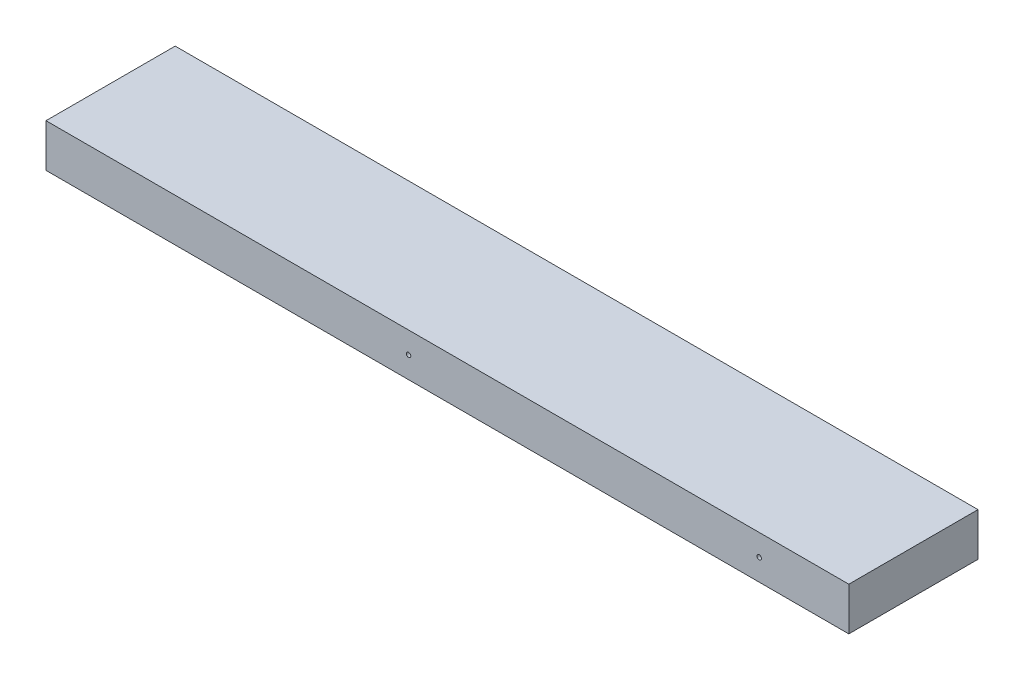
ISO-10303-21;
HEADER;
FILE_DESCRIPTION(('STEP AP214'),'2;1');
FILE_NAME('part.step','',(''),(''),'','','');
FILE_SCHEMA(('AUTOMOTIVE_DESIGN { 1 0 10303 214 1 1 1 1 }'));
ENDSEC;
DATA;
#1=APPLICATION_CONTEXT('core data for automotive mechanical design processes');
#2=APPLICATION_PROTOCOL_DEFINITION('international standard','automotive_design',2000,#1);
#3=PRODUCT_CONTEXT('',#1,'mechanical');
#4=PRODUCT('Part','Part','',(#3));
#5=PRODUCT_RELATED_PRODUCT_CATEGORY('part','',(#4));
#6=PRODUCT_DEFINITION_FORMATION('','',#4);
#7=PRODUCT_DEFINITION_CONTEXT('part definition',#1,'design');
#8=PRODUCT_DEFINITION('design','',#6,#7);
#9=PRODUCT_DEFINITION_SHAPE('','',#8);
#10=(LENGTH_UNIT() NAMED_UNIT(*) SI_UNIT(.MILLI.,.METRE.));
#11=(NAMED_UNIT(*) PLANE_ANGLE_UNIT() SI_UNIT($,.RADIAN.));
#12=(NAMED_UNIT(*) SI_UNIT($,.STERADIAN.) SOLID_ANGLE_UNIT());
#13=UNCERTAINTY_MEASURE_WITH_UNIT(LENGTH_MEASURE(1.E-05),#10,'distance_accuracy_value','');
#14=(GEOMETRIC_REPRESENTATION_CONTEXT(3) GLOBAL_UNCERTAINTY_ASSIGNED_CONTEXT((#13)) GLOBAL_UNIT_ASSIGNED_CONTEXT((#10,
#11,#12)) REPRESENTATION_CONTEXT('',''));
#15=CARTESIAN_POINT('',(0.,0.,0.));
#16=DIRECTION('',(0.,0.,1.));
#17=DIRECTION('',(1.,0.,0.));
#18=AXIS2_PLACEMENT_3D('',#15,#16,#17);
#19=CARTESIAN_POINT('',(-86.3599999999984,5213.35,2683.51));
#20=DIRECTION('',(0.,-1.,0.));
#21=DIRECTION('',(0.,0.,-1.));
#22=AXIS2_PLACEMENT_3D('',#19,#20,#21);
#23=PLANE('',#22);
#24=DIRECTION('',(0.,0.,-1.));
#25=VECTOR('',#24,1.);
#26=CARTESIAN_POINT('',(-90.1229654482436,5213.35,2740.66));
#27=LINE('',#26,#25);
#28=CARTESIAN_POINT('',(-90.1229654482436,5213.35,2740.66));
#29=VERTEX_POINT('',#28);
#30=CARTESIAN_POINT('',(-90.1229654482432,5213.35,2683.51));
#31=VERTEX_POINT('',#30);
#32=EDGE_CURVE('E101',#29,#31,#27,.T.);
#33=ORIENTED_EDGE('',*,*,#32,.F.);
#34=DIRECTION('',(1.,0.,0.));
#35=VECTOR('',#34,1.);
#36=CARTESIAN_POINT('',(-265.815570864871,5213.35,2740.66));
#37=LINE('',#36,#35);
#38=CARTESIAN_POINT('',(-445.271141729743,5213.35,2740.66));
#39=VERTEX_POINT('',#38);
#40=EDGE_CURVE('E109',#39,#29,#37,.T.);
#41=ORIENTED_EDGE('',*,*,#40,.F.);
#42=DIRECTION('',(0.,0.,-1.));
#43=VECTOR('',#42,1.);
#44=CARTESIAN_POINT('',(-445.271141729742,5213.35,2683.51));
#45=LINE('',#44,#43);
#46=CARTESIAN_POINT('',(-445.271141729742,5213.35,2683.51));
#47=VERTEX_POINT('',#46);
#48=EDGE_CURVE('E115',#39,#47,#45,.T.);
#49=ORIENTED_EDGE('',*,*,#48,.T.);
#50=DIRECTION('',(-1.,0.,0.));
#51=VECTOR('',#50,1.);
#52=CARTESIAN_POINT('',(-265.81557086487,5213.35,2683.51));
#53=LINE('',#52,#51);
#54=EDGE_CURVE('E110',#31,#47,#53,.T.);
#55=ORIENTED_EDGE('',*,*,#54,.F.);
#56=EDGE_LOOP('',(#33,#41,#49,#55));
#57=FACE_BOUND('',#56,.T.);
#58=ADVANCED_FACE('F46',(#57),#23,.T.);
#59=CARTESIAN_POINT('',(-265.815570864871,5222.875,2740.66));
#60=DIRECTION('',(0.,0.,-1.));
#61=DIRECTION('',(1.,0.,0.));
#62=AXIS2_PLACEMENT_3D('',#59,#60,#61);
#63=PLANE('',#62);
#64=CARTESIAN_POINT('',(-129.74574903147,5222.875,2740.66));
#65=DIRECTION('',(0.,0.,1.));
#66=DIRECTION('',(1.,0.,0.));
#67=AXIS2_PLACEMENT_3D('',#64,#65,#66);
#68=CIRCLE('',#67,0.991870000000006);
#69=CARTESIAN_POINT('',(-128.75387903147,5222.875,2740.66));
#70=VERTEX_POINT('',#69);
#71=EDGE_CURVE('E49',#70,#70,#68,.T.);
#72=ORIENTED_EDGE('',*,*,#71,.F.);
#73=EDGE_LOOP('',(#72));
#74=FACE_BOUND('',#73,.T.);
#75=CARTESIAN_POINT('',(-284.876857239857,5222.875,2740.66));
#76=DIRECTION('',(0.,0.,1.));
#77=DIRECTION('',(1.,0.,0.));
#78=AXIS2_PLACEMENT_3D('',#75,#76,#77);
#79=CIRCLE('',#78,0.991870000000006);
#80=CARTESIAN_POINT('',(-283.884987239857,5222.875,2740.66));
#81=VERTEX_POINT('',#80);
#82=EDGE_CURVE('E113',#81,#81,#79,.T.);
#83=ORIENTED_EDGE('',*,*,#82,.F.);
#84=EDGE_LOOP('',(#83));
#85=FACE_BOUND('',#84,.T.);
#86=ORIENTED_EDGE('',*,*,#40,.T.);
#87=DIRECTION('',(0.,1.,0.));
#88=VECTOR('',#87,1.);
#89=CARTESIAN_POINT('',(-90.1229654482436,5213.35,2740.66));
#90=LINE('',#89,#88);
#91=CARTESIAN_POINT('',(-90.1229654482438,5232.4,2740.66));
#92=VERTEX_POINT('',#91);
#93=EDGE_CURVE('E98',#29,#92,#90,.T.);
#94=ORIENTED_EDGE('',*,*,#93,.T.);
#95=DIRECTION('',(-1.,0.,0.));
#96=VECTOR('',#95,1.);
#97=CARTESIAN_POINT('',(-445.271141729744,5232.4,2740.66));
#98=LINE('',#97,#96);
#99=CARTESIAN_POINT('',(-445.271141729743,5232.4,2740.66));
#100=VERTEX_POINT('',#99);
#101=EDGE_CURVE('E125',#92,#100,#98,.T.);
#102=ORIENTED_EDGE('',*,*,#101,.T.);
#103=DIRECTION('',(0.,1.,0.));
#104=VECTOR('',#103,1.);
#105=CARTESIAN_POINT('',(-445.271141729743,5213.35,2740.66));
#106=LINE('',#105,#104);
#107=EDGE_CURVE('E83',#100,#39,#106,.F.);
#108=ORIENTED_EDGE('',*,*,#107,.T.);
#109=EDGE_LOOP('',(#86,#94,#102,#108));
#110=FACE_BOUND('',#109,.T.);
#111=ADVANCED_FACE('F112',(#74,#85,#110),#63,.F.);
#112=CARTESIAN_POINT('',(-445.271141729742,5213.35,2683.51));
#113=DIRECTION('',(-1.,0.,0.));
#114=DIRECTION('',(0.,0.,-1.));
#115=AXIS2_PLACEMENT_3D('',#112,#113,#114);
#116=PLANE('',#115);
#117=DIRECTION('',(0.,1.,0.));
#118=VECTOR('',#117,1.);
#119=CARTESIAN_POINT('',(-445.271141729742,5222.875,2683.51));
#120=LINE('',#119,#118);
#121=CARTESIAN_POINT('',(-445.271141729744,5232.4,2683.51));
#122=VERTEX_POINT('',#121);
#123=EDGE_CURVE('E122',#47,#122,#120,.T.);
#124=ORIENTED_EDGE('',*,*,#123,.F.);
#125=ORIENTED_EDGE('',*,*,#48,.F.);
#126=ORIENTED_EDGE('',*,*,#107,.F.);
#127=DIRECTION('',(0.,0.,1.));
#128=VECTOR('',#127,1.);
#129=CARTESIAN_POINT('',(-445.271141729744,5232.4,2683.51));
#130=LINE('',#129,#128);
#131=EDGE_CURVE('E54',#100,#122,#130,.F.);
#132=ORIENTED_EDGE('',*,*,#131,.T.);
#133=EDGE_LOOP('',(#124,#125,#126,#132));
#134=FACE_BOUND('',#133,.T.);
#135=ADVANCED_FACE('F139',(#134),#116,.T.);
#136=CARTESIAN_POINT('',(-265.815570864871,5222.875,2683.51));
#137=DIRECTION('',(0.,0.,1.));
#138=DIRECTION('',(-1.,0.,0.));
#139=AXIS2_PLACEMENT_3D('',#136,#137,#138);
#140=PLANE('',#139);
#141=DIRECTION('',(-1.,0.,0.));
#142=VECTOR('',#141,1.);
#143=CARTESIAN_POINT('',(-445.271141729744,5232.4,2683.51));
#144=LINE('',#143,#142);
#145=CARTESIAN_POINT('',(-90.1229654482437,5232.4,2683.51));
#146=VERTEX_POINT('',#145);
#147=EDGE_CURVE('E11',#122,#146,#144,.F.);
#148=ORIENTED_EDGE('',*,*,#147,.T.);
#149=DIRECTION('',(0.,1.,0.));
#150=VECTOR('',#149,1.);
#151=CARTESIAN_POINT('',(-90.1229654482432,5213.35,2683.51));
#152=LINE('',#151,#150);
#153=EDGE_CURVE('E62',#31,#146,#152,.T.);
#154=ORIENTED_EDGE('',*,*,#153,.F.);
#155=ORIENTED_EDGE('',*,*,#54,.T.);
#156=ORIENTED_EDGE('',*,*,#123,.T.);
#157=EDGE_LOOP('',(#148,#154,#155,#156));
#158=FACE_BOUND('',#157,.T.);
#159=ADVANCED_FACE('F136',(#158),#140,.F.);
#160=CARTESIAN_POINT('',(-445.271141729744,5232.4,2683.51));
#161=DIRECTION('',(0.,1.,0.));
#162=DIRECTION('',(0.,0.,1.));
#163=AXIS2_PLACEMENT_3D('',#160,#161,#162);
#164=PLANE('',#163);
#165=DIRECTION('',(0.,0.,-1.));
#166=VECTOR('',#165,1.);
#167=CARTESIAN_POINT('',(-90.1229654482438,5232.4,2740.66));
#168=LINE('',#167,#166);
#169=EDGE_CURVE('E102',#92,#146,#168,.T.);
#170=ORIENTED_EDGE('',*,*,#169,.T.);
#171=ORIENTED_EDGE('',*,*,#147,.F.);
#172=ORIENTED_EDGE('',*,*,#131,.F.);
#173=ORIENTED_EDGE('',*,*,#101,.F.);
#174=EDGE_LOOP('',(#170,#171,#172,#173));
#175=FACE_BOUND('',#174,.T.);
#176=ADVANCED_FACE('F134',(#175),#164,.T.);
#177=CARTESIAN_POINT('',(-284.876857239857,5222.875,2759.71000000001));
#178=DIRECTION('',(0.,0.,1.));
#179=DIRECTION('',(-1.,0.,0.));
#180=AXIS2_PLACEMENT_3D('',#177,#178,#179);
#181=CYLINDRICAL_SURFACE('',#180,0.991870000000006);
#182=CARTESIAN_POINT('',(-284.876857239858,5222.875,2721.61000000001));
#183=DIRECTION('',(0.,0.,-1.));
#184=DIRECTION('',(-1.,0.,0.));
#185=AXIS2_PLACEMENT_3D('',#182,#183,#184);
#186=CIRCLE('',#185,0.991870000000006);
#187=CARTESIAN_POINT('',(-285.868727239858,5222.875,2721.61000000001));
#188=VERTEX_POINT('',#187);
#189=EDGE_CURVE('E118',#188,#188,#186,.T.);
#190=ORIENTED_EDGE('',*,*,#189,.T.);
#191=EDGE_LOOP('',(#190));
#192=FACE_BOUND('',#191,.T.);
#193=ORIENTED_EDGE('',*,*,#82,.T.);
#194=EDGE_LOOP('',(#193));
#195=FACE_BOUND('',#194,.T.);
#196=ADVANCED_FACE('F179',(#192,#195),#181,.F.);
#197=CARTESIAN_POINT('',(-284.876857239858,5222.875,2721.61000000001));
#198=DIRECTION('',(0.,0.,1.));
#199=DIRECTION('',(-1.,0.,0.));
#200=AXIS2_PLACEMENT_3D('',#197,#198,#199);
#201=CONICAL_SURFACE('',#200,0.991870000000006,1.02974425867677);
#202=CARTESIAN_POINT('',(-284.876857239857,5222.875,2721.01402437781));
#203=VERTEX_POINT('',#202);
#204=VERTEX_LOOP('',#203);
#205=FACE_BOUND('',#204,.T.);
#206=ORIENTED_EDGE('',*,*,#189,.F.);
#207=EDGE_LOOP('',(#206));
#208=FACE_BOUND('',#207,.T.);
#209=ADVANCED_FACE('F192',(#205,#208),#201,.F.);
#210=CARTESIAN_POINT('',(-129.745749031471,5222.875,2759.71000000001));
#211=DIRECTION('',(0.,0.,1.));
#212=DIRECTION('',(-1.,0.,0.));
#213=AXIS2_PLACEMENT_3D('',#210,#211,#212);
#214=CYLINDRICAL_SURFACE('',#213,0.991870000000006);
#215=CARTESIAN_POINT('',(-129.74574903147,5222.875,2721.61000000001));
#216=DIRECTION('',(0.,0.,-1.));
#217=DIRECTION('',(-1.,0.,0.));
#218=AXIS2_PLACEMENT_3D('',#215,#216,#217);
#219=CIRCLE('',#218,0.991870000000006);
#220=CARTESIAN_POINT('',(-130.73761903147,5222.875,2721.61000000001));
#221=VERTEX_POINT('',#220);
#222=EDGE_CURVE('E130',#221,#221,#219,.T.);
#223=ORIENTED_EDGE('',*,*,#222,.T.);
#224=EDGE_LOOP('',(#223));
#225=FACE_BOUND('',#224,.T.);
#226=ORIENTED_EDGE('',*,*,#71,.T.);
#227=EDGE_LOOP('',(#226));
#228=FACE_BOUND('',#227,.T.);
#229=ADVANCED_FACE('F200',(#225,#228),#214,.F.);
#230=CARTESIAN_POINT('',(-129.74574903147,5222.875,2721.61000000001));
#231=DIRECTION('',(0.,0.,1.));
#232=DIRECTION('',(-1.,0.,0.));
#233=AXIS2_PLACEMENT_3D('',#230,#231,#232);
#234=CONICAL_SURFACE('',#233,0.991870000000006,1.02974425867677);
#235=CARTESIAN_POINT('',(-129.74574903147,5222.875,2721.01402437781));
#236=VERTEX_POINT('',#235);
#237=VERTEX_LOOP('',#236);
#238=FACE_BOUND('',#237,.T.);
#239=ORIENTED_EDGE('',*,*,#222,.F.);
#240=EDGE_LOOP('',(#239));
#241=FACE_BOUND('',#240,.T.);
#242=ADVANCED_FACE('F207',(#238,#241),#234,.F.);
#243=CARTESIAN_POINT('',(-90.1229654482436,5213.35,2740.66));
#244=DIRECTION('',(-1.,0.,0.));
#245=DIRECTION('',(0.,0.,1.));
#246=AXIS2_PLACEMENT_3D('',#243,#244,#245);
#247=PLANE('',#246);
#248=ORIENTED_EDGE('',*,*,#153,.T.);
#249=ORIENTED_EDGE('',*,*,#169,.F.);
#250=ORIENTED_EDGE('',*,*,#93,.F.);
#251=ORIENTED_EDGE('',*,*,#32,.T.);
#252=EDGE_LOOP('',(#248,#249,#250,#251));
#253=FACE_BOUND('',#252,.T.);
#254=ADVANCED_FACE('F100',(#253),#247,.F.);
#255=CLOSED_SHELL('',(#58,#111,#135,#159,#176,#196,#209,#229,#242,#254));
#256=MANIFOLD_SOLID_BREP('B2',#255);
#257=ADVANCED_BREP_SHAPE_REPRESENTATION('',(#18,#256),#14);
#258=SHAPE_DEFINITION_REPRESENTATION(#9,#257);
ENDSEC;
END-ISO-10303-21;
